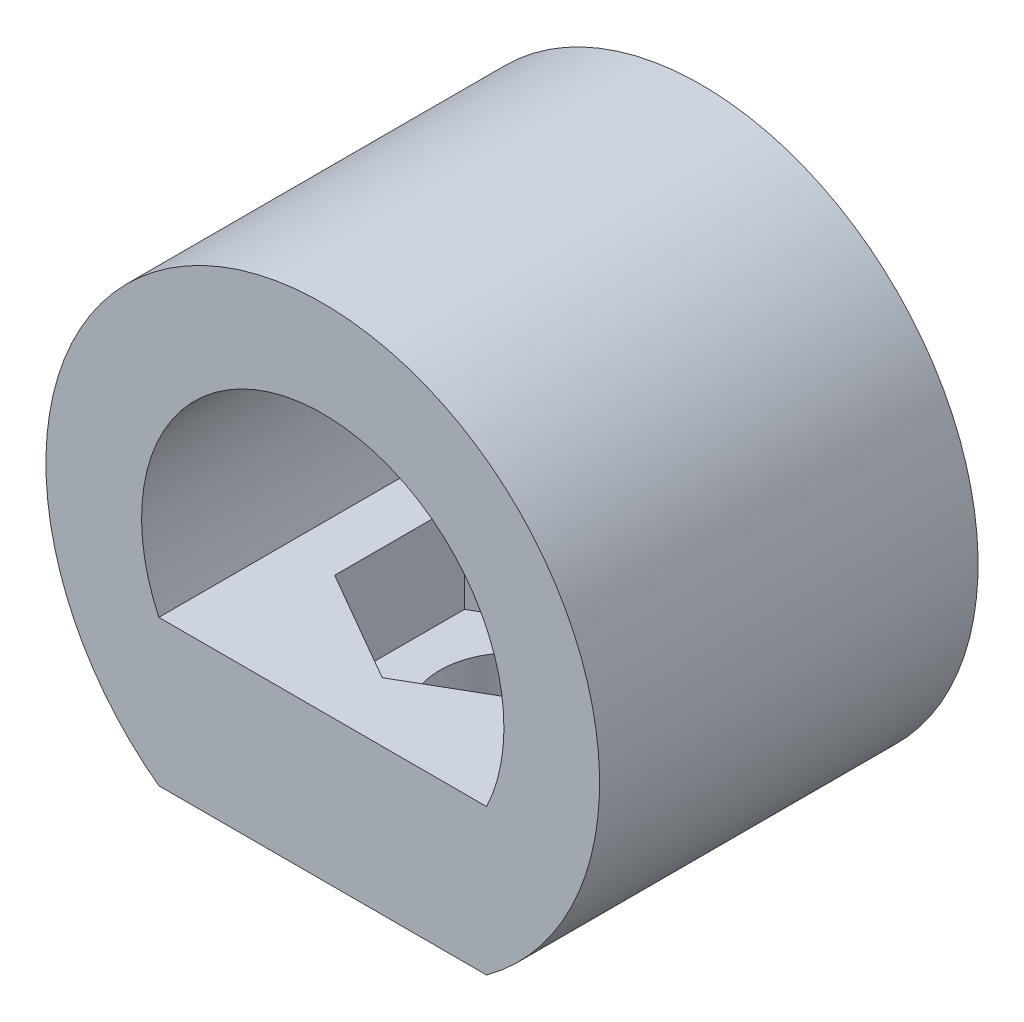
ISO-10303-21;
HEADER;
FILE_DESCRIPTION(('STEP AP214'),'2;1');
FILE_NAME('part.step','',(''),(''),'','','');
FILE_SCHEMA(('AUTOMOTIVE_DESIGN { 1 0 10303 214 1 1 1 1 }'));
ENDSEC;
DATA;
#1=APPLICATION_CONTEXT('core data for automotive mechanical design processes');
#2=APPLICATION_PROTOCOL_DEFINITION('international standard','automotive_design',2000,#1);
#3=PRODUCT_CONTEXT('',#1,'mechanical');
#4=PRODUCT('Part','Part','',(#3));
#5=PRODUCT_RELATED_PRODUCT_CATEGORY('part','',(#4));
#6=PRODUCT_DEFINITION_FORMATION('','',#4);
#7=PRODUCT_DEFINITION_CONTEXT('part definition',#1,'design');
#8=PRODUCT_DEFINITION('design','',#6,#7);
#9=PRODUCT_DEFINITION_SHAPE('','',#8);
#10=(LENGTH_UNIT() NAMED_UNIT(*) SI_UNIT(.MILLI.,.METRE.));
#11=(NAMED_UNIT(*) PLANE_ANGLE_UNIT() SI_UNIT($,.RADIAN.));
#12=(NAMED_UNIT(*) SI_UNIT($,.STERADIAN.) SOLID_ANGLE_UNIT());
#13=UNCERTAINTY_MEASURE_WITH_UNIT(LENGTH_MEASURE(1.E-05),#10,'distance_accuracy_value','');
#14=(GEOMETRIC_REPRESENTATION_CONTEXT(3) GLOBAL_UNCERTAINTY_ASSIGNED_CONTEXT((#13)) GLOBAL_UNIT_ASSIGNED_CONTEXT((#10,
#11,#12)) REPRESENTATION_CONTEXT('',''));
#15=CARTESIAN_POINT('',(0.,0.,0.));
#16=DIRECTION('',(0.,0.,1.));
#17=DIRECTION('',(1.,0.,0.));
#18=AXIS2_PLACEMENT_3D('',#15,#16,#17);
#19=CARTESIAN_POINT('',(0.,5.5,11.0273901415219));
#20=DIRECTION('',(0.,0.,-1.));
#21=DIRECTION('',(-1.,0.,0.));
#22=AXIS2_PLACEMENT_3D('',#19,#20,#21);
#23=PLANE('',#22);
#24=CARTESIAN_POINT('',(0.,10.,11.0273901415219));
#25=DIRECTION('',(0.,0.,-1.));
#26=DIRECTION('',(-1.,0.,0.));
#27=AXIS2_PLACEMENT_3D('',#24,#25,#26);
#28=CIRCLE('',#27,16.1307935328675);
#29=CARTESIAN_POINT('',(-9.55000000000001,-3.,11.0273901415219));
#30=VERTEX_POINT('',#29);
#31=CARTESIAN_POINT('',(9.55000000000001,-3.,11.0273901415219));
#32=VERTEX_POINT('',#31);
#33=EDGE_CURVE('E211',#30,#32,#28,.T.);
#34=ORIENTED_EDGE('',*,*,#33,.F.);
#35=DIRECTION('',(-1.,0.,0.));
#36=VECTOR('',#35,1.);
#37=CARTESIAN_POINT('',(-9.55000000000001,-3.,11.0273901415219));
#38=LINE('',#37,#36);
#39=EDGE_CURVE('E136',#32,#30,#38,.T.);
#40=ORIENTED_EDGE('',*,*,#39,.F.);
#41=EDGE_LOOP('',(#34,#40));
#42=FACE_BOUND('',#41,.T.);
#43=DIRECTION('',(1.,0.,0.));
#44=VECTOR('',#43,1.);
#45=CARTESIAN_POINT('',(0.,5.5,11.0273901415219));
#46=LINE('',#45,#44);
#47=CARTESIAN_POINT('',(-9.55000000000001,5.5,11.0273901415219));
#48=VERTEX_POINT('',#47);
#49=CARTESIAN_POINT('',(9.55000000000001,5.5,11.0273901415219));
#50=VERTEX_POINT('',#49);
#51=EDGE_CURVE('E123',#48,#50,#46,.T.);
#52=ORIENTED_EDGE('',*,*,#51,.F.);
#53=CARTESIAN_POINT('',(0.,10.,11.0273901415219));
#54=DIRECTION('',(0.,0.,-1.));
#55=DIRECTION('',(-1.,0.,0.));
#56=AXIS2_PLACEMENT_3D('',#53,#54,#55);
#57=CIRCLE('',#56,10.5571066111885);
#58=EDGE_CURVE('E253',#48,#50,#57,.T.);
#59=ORIENTED_EDGE('',*,*,#58,.T.);
#60=EDGE_LOOP('',(#52,#59));
#61=FACE_BOUND('',#60,.T.);
#62=ADVANCED_FACE('F37',(#42,#61),#23,.F.);
#63=CARTESIAN_POINT('',(3.275,5.5,5.67246639478808));
#64=DIRECTION('',(-0.5,0.,-0.866025403784439));
#65=DIRECTION('',(-0.866025403784439,0.,0.5));
#66=AXIS2_PLACEMENT_3D('',#63,#64,#65);
#67=PLANE('',#66);
#68=DIRECTION('',(0.866025403784439,0.,-0.5));
#69=VECTOR('',#68,1.);
#70=CARTESIAN_POINT('',(3.275,0.,5.67246639478808));
#71=LINE('',#70,#69);
#72=CARTESIAN_POINT('',(0.,0.,7.56328852638411));
#73=VERTEX_POINT('',#72);
#74=CARTESIAN_POINT('',(6.55,0.,3.78164426319205));
#75=VERTEX_POINT('',#74);
#76=EDGE_CURVE('E132',#73,#75,#71,.T.);
#77=ORIENTED_EDGE('',*,*,#76,.F.);
#78=DIRECTION('',(0.,-1.,0.));
#79=VECTOR('',#78,1.);
#80=CARTESIAN_POINT('',(0.,5.5,7.56328852638411));
#81=LINE('',#80,#79);
#82=CARTESIAN_POINT('',(0.,5.5,7.56328852638411));
#83=VERTEX_POINT('',#82);
#84=EDGE_CURVE('E11',#83,#73,#81,.T.);
#85=ORIENTED_EDGE('',*,*,#84,.F.);
#86=DIRECTION('',(0.866025403784439,0.,-0.5));
#87=VECTOR('',#86,1.);
#88=CARTESIAN_POINT('',(3.275,5.5,5.67246639478808));
#89=LINE('',#88,#87);
#90=CARTESIAN_POINT('',(6.55,5.5,3.78164426319205));
#91=VERTEX_POINT('',#90);
#92=EDGE_CURVE('E148',#83,#91,#89,.T.);
#93=ORIENTED_EDGE('',*,*,#92,.T.);
#94=DIRECTION('',(0.,-1.,0.));
#95=VECTOR('',#94,1.);
#96=CARTESIAN_POINT('',(6.55,5.5,3.78164426319205));
#97=LINE('',#96,#95);
#98=EDGE_CURVE('E54',#91,#75,#97,.T.);
#99=ORIENTED_EDGE('',*,*,#98,.T.);
#100=EDGE_LOOP('',(#77,#85,#93,#99));
#101=FACE_BOUND('',#100,.T.);
#102=ADVANCED_FACE('F39',(#101),#67,.T.);
#103=CARTESIAN_POINT('',(-3.27500000000001,5.5,5.67246639478808));
#104=DIRECTION('',(0.500000000000001,0.,-0.866025403784438));
#105=DIRECTION('',(-0.866025403784438,0.,-0.500000000000001));
#106=AXIS2_PLACEMENT_3D('',#103,#104,#105);
#107=PLANE('',#106);
#108=DIRECTION('',(0.866025403784438,0.,0.500000000000001));
#109=VECTOR('',#108,1.);
#110=CARTESIAN_POINT('',(-3.27500000000001,0.,5.67246639478808));
#111=LINE('',#110,#109);
#112=CARTESIAN_POINT('',(-6.55000000000001,0.,3.78164426319205));
#113=VERTEX_POINT('',#112);
#114=EDGE_CURVE('E135',#113,#73,#111,.T.);
#115=ORIENTED_EDGE('',*,*,#114,.F.);
#116=DIRECTION('',(0.,-1.,0.));
#117=VECTOR('',#116,1.);
#118=CARTESIAN_POINT('',(-6.55000000000001,5.5,3.78164426319205));
#119=LINE('',#118,#117);
#120=CARTESIAN_POINT('',(-6.55000000000001,5.5,3.78164426319205));
#121=VERTEX_POINT('',#120);
#122=EDGE_CURVE('E46',#121,#113,#119,.T.);
#123=ORIENTED_EDGE('',*,*,#122,.F.);
#124=DIRECTION('',(0.866025403784438,0.,0.500000000000001));
#125=VECTOR('',#124,1.);
#126=CARTESIAN_POINT('',(-3.27500000000001,5.5,5.67246639478808));
#127=LINE('',#126,#125);
#128=EDGE_CURVE('E232',#121,#83,#127,.T.);
#129=ORIENTED_EDGE('',*,*,#128,.T.);
#130=ORIENTED_EDGE('',*,*,#84,.T.);
#131=EDGE_LOOP('',(#115,#123,#129,#130));
#132=FACE_BOUND('',#131,.T.);
#133=ADVANCED_FACE('F157',(#132),#107,.T.);
#134=CARTESIAN_POINT('',(-6.55000000000001,5.5,0.));
#135=DIRECTION('',(1.,0.,0.));
#136=DIRECTION('',(0.,0.,-1.));
#137=AXIS2_PLACEMENT_3D('',#134,#135,#136);
#138=PLANE('',#137);
#139=DIRECTION('',(0.,0.,1.));
#140=VECTOR('',#139,1.);
#141=CARTESIAN_POINT('',(-6.55000000000001,0.,0.));
#142=LINE('',#141,#140);
#143=CARTESIAN_POINT('',(-6.55000000000001,0.,-3.78164426319206));
#144=VERTEX_POINT('',#143);
#145=EDGE_CURVE('E139',#144,#113,#142,.T.);
#146=ORIENTED_EDGE('',*,*,#145,.F.);
#147=DIRECTION('',(0.,-1.,0.));
#148=VECTOR('',#147,1.);
#149=CARTESIAN_POINT('',(-6.55000000000001,5.5,-3.78164426319206));
#150=LINE('',#149,#148);
#151=CARTESIAN_POINT('',(-6.55000000000001,5.5,-3.78164426319206));
#152=VERTEX_POINT('',#151);
#153=EDGE_CURVE('E101',#152,#144,#150,.T.);
#154=ORIENTED_EDGE('',*,*,#153,.F.);
#155=DIRECTION('',(0.,0.,1.));
#156=VECTOR('',#155,1.);
#157=CARTESIAN_POINT('',(-6.55000000000001,5.5,0.));
#158=LINE('',#157,#156);
#159=EDGE_CURVE('E112',#152,#121,#158,.T.);
#160=ORIENTED_EDGE('',*,*,#159,.T.);
#161=ORIENTED_EDGE('',*,*,#122,.T.);
#162=EDGE_LOOP('',(#146,#154,#160,#161));
#163=FACE_BOUND('',#162,.T.);
#164=ADVANCED_FACE('F154',(#163),#138,.T.);
#165=CARTESIAN_POINT('',(-3.27500000000001,5.5,-5.67246639478808));
#166=DIRECTION('',(0.5,0.,0.866025403784438));
#167=DIRECTION('',(0.866025403784438,0.,-0.5));
#168=AXIS2_PLACEMENT_3D('',#165,#166,#167);
#169=PLANE('',#168);
#170=DIRECTION('',(-0.866025403784438,0.,0.5));
#171=VECTOR('',#170,1.);
#172=CARTESIAN_POINT('',(-3.27500000000001,0.,-5.67246639478808));
#173=LINE('',#172,#171);
#174=CARTESIAN_POINT('',(0.,0.,-7.56328852638411));
#175=VERTEX_POINT('',#174);
#176=EDGE_CURVE('E97',#175,#144,#173,.T.);
#177=ORIENTED_EDGE('',*,*,#176,.F.);
#178=DIRECTION('',(0.,-1.,0.));
#179=VECTOR('',#178,1.);
#180=CARTESIAN_POINT('',(0.,5.5,-7.56328852638411));
#181=LINE('',#180,#179);
#182=CARTESIAN_POINT('',(0.,5.5,-7.56328852638411));
#183=VERTEX_POINT('',#182);
#184=EDGE_CURVE('E92',#183,#175,#181,.T.);
#185=ORIENTED_EDGE('',*,*,#184,.F.);
#186=DIRECTION('',(-0.866025403784438,0.,0.5));
#187=VECTOR('',#186,1.);
#188=CARTESIAN_POINT('',(-3.27500000000001,5.5,-5.67246639478808));
#189=LINE('',#188,#187);
#190=EDGE_CURVE('E95',#183,#152,#189,.T.);
#191=ORIENTED_EDGE('',*,*,#190,.T.);
#192=ORIENTED_EDGE('',*,*,#153,.T.);
#193=EDGE_LOOP('',(#177,#185,#191,#192));
#194=FACE_BOUND('',#193,.T.);
#195=ADVANCED_FACE('F94',(#194),#169,.T.);
#196=CARTESIAN_POINT('',(3.275,5.5,-5.67246639478808));
#197=DIRECTION('',(-0.5,0.,0.866025403784439));
#198=DIRECTION('',(0.866025403784439,0.,0.5));
#199=AXIS2_PLACEMENT_3D('',#196,#197,#198);
#200=PLANE('',#199);
#201=DIRECTION('',(-0.866025403784439,0.,-0.5));
#202=VECTOR('',#201,1.);
#203=CARTESIAN_POINT('',(3.275,0.,-5.67246639478808));
#204=LINE('',#203,#202);
#205=CARTESIAN_POINT('',(6.55,0.,-3.78164426319205));
#206=VERTEX_POINT('',#205);
#207=EDGE_CURVE('E143',#206,#175,#204,.T.);
#208=ORIENTED_EDGE('',*,*,#207,.F.);
#209=DIRECTION('',(0.,-1.,0.));
#210=VECTOR('',#209,1.);
#211=CARTESIAN_POINT('',(6.55,5.5,-3.78164426319205));
#212=LINE('',#211,#210);
#213=CARTESIAN_POINT('',(6.55,5.5,-3.78164426319205));
#214=VERTEX_POINT('',#213);
#215=EDGE_CURVE('E72',#214,#206,#212,.T.);
#216=ORIENTED_EDGE('',*,*,#215,.F.);
#217=DIRECTION('',(-0.866025403784439,0.,-0.5));
#218=VECTOR('',#217,1.);
#219=CARTESIAN_POINT('',(3.275,5.5,-5.67246639478808));
#220=LINE('',#219,#218);
#221=EDGE_CURVE('E109',#214,#183,#220,.T.);
#222=ORIENTED_EDGE('',*,*,#221,.T.);
#223=ORIENTED_EDGE('',*,*,#184,.T.);
#224=EDGE_LOOP('',(#208,#216,#222,#223));
#225=FACE_BOUND('',#224,.T.);
#226=ADVANCED_FACE('F114',(#225),#200,.T.);
#227=CARTESIAN_POINT('',(6.55,5.5,0.));
#228=DIRECTION('',(-1.,0.,0.));
#229=DIRECTION('',(0.,0.,1.));
#230=AXIS2_PLACEMENT_3D('',#227,#228,#229);
#231=PLANE('',#230);
#232=DIRECTION('',(0.,0.,-1.));
#233=VECTOR('',#232,1.);
#234=CARTESIAN_POINT('',(6.55,0.,0.));
#235=LINE('',#234,#233);
#236=EDGE_CURVE('E145',#75,#206,#235,.T.);
#237=ORIENTED_EDGE('',*,*,#236,.F.);
#238=ORIENTED_EDGE('',*,*,#98,.F.);
#239=DIRECTION('',(0.,0.,-1.));
#240=VECTOR('',#239,1.);
#241=CARTESIAN_POINT('',(6.55,5.5,0.));
#242=LINE('',#241,#240);
#243=EDGE_CURVE('E115',#91,#214,#242,.T.);
#244=ORIENTED_EDGE('',*,*,#243,.T.);
#245=ORIENTED_EDGE('',*,*,#215,.T.);
#246=EDGE_LOOP('',(#237,#238,#244,#245));
#247=FACE_BOUND('',#246,.T.);
#248=ADVANCED_FACE('F160',(#247),#231,.T.);
#249=CARTESIAN_POINT('',(0.,5.5,-11.0273901415219));
#250=DIRECTION('',(0.,0.,-1.));
#251=DIRECTION('',(-1.,0.,0.));
#252=AXIS2_PLACEMENT_3D('',#249,#250,#251);
#253=PLANE('',#252);
#254=DIRECTION('',(1.,0.,0.));
#255=VECTOR('',#254,1.);
#256=CARTESIAN_POINT('',(-9.55000000000001,-3.,-11.0273901415219));
#257=LINE('',#256,#255);
#258=CARTESIAN_POINT('',(-9.55000000000001,-3.,-11.0273901415219));
#259=VERTEX_POINT('',#258);
#260=CARTESIAN_POINT('',(9.55000000000001,-3.,-11.0273901415219));
#261=VERTEX_POINT('',#260);
#262=EDGE_CURVE('E221',#259,#261,#257,.T.);
#263=ORIENTED_EDGE('',*,*,#262,.F.);
#264=CARTESIAN_POINT('',(0.,10.,-11.0273901415219));
#265=DIRECTION('',(0.,0.,-1.));
#266=DIRECTION('',(-1.,0.,0.));
#267=AXIS2_PLACEMENT_3D('',#264,#265,#266);
#268=CIRCLE('',#267,16.1307935328675);
#269=EDGE_CURVE('E215',#261,#259,#268,.F.);
#270=ORIENTED_EDGE('',*,*,#269,.F.);
#271=EDGE_LOOP('',(#263,#270));
#272=FACE_BOUND('',#271,.T.);
#273=DIRECTION('',(1.,0.,0.));
#274=VECTOR('',#273,1.);
#275=CARTESIAN_POINT('',(0.,5.5,-11.0273901415219));
#276=LINE('',#275,#274);
#277=CARTESIAN_POINT('',(-9.55000000000001,5.5,-11.0273901415219));
#278=VERTEX_POINT('',#277);
#279=CARTESIAN_POINT('',(9.55000000000001,5.5,-11.0273901415219));
#280=VERTEX_POINT('',#279);
#281=EDGE_CURVE('E129',#278,#280,#276,.T.);
#282=ORIENTED_EDGE('',*,*,#281,.T.);
#283=CARTESIAN_POINT('',(0.,10.,-11.0273901415219));
#284=DIRECTION('',(0.,0.,-1.));
#285=DIRECTION('',(-1.,0.,0.));
#286=AXIS2_PLACEMENT_3D('',#283,#284,#285);
#287=CIRCLE('',#286,10.5571066111885);
#288=EDGE_CURVE('E247',#280,#278,#287,.F.);
#289=ORIENTED_EDGE('',*,*,#288,.T.);
#290=EDGE_LOOP('',(#282,#289));
#291=FACE_BOUND('',#290,.T.);
#292=ADVANCED_FACE('F162',(#272,#291),#253,.T.);
#293=CARTESIAN_POINT('',(0.,5.5,0.));
#294=DIRECTION('',(0.,1.,0.));
#295=DIRECTION('',(0.,0.,1.));
#296=AXIS2_PLACEMENT_3D('',#293,#294,#295);
#297=PLANE('',#296);
#298=ORIENTED_EDGE('',*,*,#92,.F.);
#299=ORIENTED_EDGE('',*,*,#128,.F.);
#300=ORIENTED_EDGE('',*,*,#159,.F.);
#301=ORIENTED_EDGE('',*,*,#190,.F.);
#302=ORIENTED_EDGE('',*,*,#221,.F.);
#303=ORIENTED_EDGE('',*,*,#243,.F.);
#304=EDGE_LOOP('',(#298,#299,#300,#301,#302,#303));
#305=FACE_BOUND('',#304,.T.);
#306=DIRECTION('',(0.,0.,1.));
#307=VECTOR('',#306,1.);
#308=CARTESIAN_POINT('',(-9.55000000000001,5.5,0.));
#309=LINE('',#308,#307);
#310=EDGE_CURVE('E117',#278,#48,#309,.T.);
#311=ORIENTED_EDGE('',*,*,#310,.T.);
#312=ORIENTED_EDGE('',*,*,#51,.T.);
#313=DIRECTION('',(0.,0.,-1.));
#314=VECTOR('',#313,1.);
#315=CARTESIAN_POINT('',(9.55,5.5,0.));
#316=LINE('',#315,#314);
#317=EDGE_CURVE('E126',#50,#280,#316,.T.);
#318=ORIENTED_EDGE('',*,*,#317,.T.);
#319=ORIENTED_EDGE('',*,*,#281,.F.);
#320=EDGE_LOOP('',(#311,#312,#318,#319));
#321=FACE_BOUND('',#320,.T.);
#322=ADVANCED_FACE('F106',(#305,#321),#297,.T.);
#323=CARTESIAN_POINT('',(0.,0.,0.));
#324=DIRECTION('',(0.,-1.,0.));
#325=DIRECTION('',(0.,0.,-1.));
#326=AXIS2_PLACEMENT_3D('',#323,#324,#325);
#327=PLANE('',#326);
#328=CARTESIAN_POINT('',(0.,0.,0.));
#329=DIRECTION('',(0.,-1.,0.));
#330=DIRECTION('',(0.,0.,-1.));
#331=AXIS2_PLACEMENT_3D('',#328,#329,#330);
#332=CIRCLE('',#331,4.2);
#333=CARTESIAN_POINT('',(0.,0.,-4.2));
#334=VERTEX_POINT('',#333);
#335=EDGE_CURVE('E250',#334,#334,#332,.T.);
#336=ORIENTED_EDGE('',*,*,#335,.T.);
#337=EDGE_LOOP('',(#336));
#338=FACE_BOUND('',#337,.T.);
#339=ORIENTED_EDGE('',*,*,#114,.T.);
#340=ORIENTED_EDGE('',*,*,#76,.T.);
#341=ORIENTED_EDGE('',*,*,#236,.T.);
#342=ORIENTED_EDGE('',*,*,#207,.T.);
#343=ORIENTED_EDGE('',*,*,#176,.T.);
#344=ORIENTED_EDGE('',*,*,#145,.T.);
#345=EDGE_LOOP('',(#339,#340,#341,#342,#343,#344));
#346=FACE_BOUND('',#345,.T.);
#347=ADVANCED_FACE('F159',(#338,#346),#327,.F.);
#348=CARTESIAN_POINT('',(0.,-3.,0.));
#349=DIRECTION('',(0.,-1.,0.));
#350=DIRECTION('',(0.,0.,-1.));
#351=AXIS2_PLACEMENT_3D('',#348,#349,#350);
#352=PLANE('',#351);
#353=DIRECTION('',(0.,0.,-1.));
#354=VECTOR('',#353,1.);
#355=CARTESIAN_POINT('',(-9.55000000000001,-3.,11.0273901415219));
#356=LINE('',#355,#354);
#357=EDGE_CURVE('E207',#30,#259,#356,.T.);
#358=ORIENTED_EDGE('',*,*,#357,.T.);
#359=ORIENTED_EDGE('',*,*,#262,.T.);
#360=DIRECTION('',(0.,0.,1.));
#361=VECTOR('',#360,1.);
#362=CARTESIAN_POINT('',(9.55000000000001,-3.,11.0273901415219));
#363=LINE('',#362,#361);
#364=EDGE_CURVE('E226',#261,#32,#363,.T.);
#365=ORIENTED_EDGE('',*,*,#364,.T.);
#366=ORIENTED_EDGE('',*,*,#39,.T.);
#367=EDGE_LOOP('',(#358,#359,#365,#366));
#368=FACE_BOUND('',#367,.T.);
#369=CARTESIAN_POINT('',(0.,-3.,0.));
#370=DIRECTION('',(0.,-1.,0.));
#371=DIRECTION('',(0.,0.,-1.));
#372=AXIS2_PLACEMENT_3D('',#369,#370,#371);
#373=CIRCLE('',#372,4.2);
#374=CARTESIAN_POINT('',(0.,-3.,-4.2));
#375=VERTEX_POINT('',#374);
#376=EDGE_CURVE('E222',#375,#375,#373,.T.);
#377=ORIENTED_EDGE('',*,*,#376,.F.);
#378=EDGE_LOOP('',(#377));
#379=FACE_BOUND('',#378,.T.);
#380=ADVANCED_FACE('F184',(#368,#379),#352,.T.);
#381=CARTESIAN_POINT('',(0.,-3.,0.));
#382=DIRECTION('',(0.,1.,0.));
#383=DIRECTION('',(0.,0.,1.));
#384=AXIS2_PLACEMENT_3D('',#381,#382,#383);
#385=CYLINDRICAL_SURFACE('',#384,4.2);
#386=ORIENTED_EDGE('',*,*,#376,.T.);
#387=EDGE_LOOP('',(#386));
#388=FACE_BOUND('',#387,.T.);
#389=ORIENTED_EDGE('',*,*,#335,.F.);
#390=EDGE_LOOP('',(#389));
#391=FACE_BOUND('',#390,.T.);
#392=ADVANCED_FACE('F188',(#388,#391),#385,.F.);
#393=CARTESIAN_POINT('',(0.,10.,54.4947702311311));
#394=DIRECTION('',(0.,0.,-1.));
#395=DIRECTION('',(-1.,0.,0.));
#396=AXIS2_PLACEMENT_3D('',#393,#394,#395);
#397=CYLINDRICAL_SURFACE('',#396,16.1307935328675);
#398=ORIENTED_EDGE('',*,*,#357,.F.);
#399=ORIENTED_EDGE('',*,*,#33,.T.);
#400=ORIENTED_EDGE('',*,*,#364,.F.);
#401=ORIENTED_EDGE('',*,*,#269,.T.);
#402=EDGE_LOOP('',(#398,#399,#400,#401));
#403=FACE_BOUND('',#402,.T.);
#404=ADVANCED_FACE('F192',(#403),#397,.T.);
#405=CARTESIAN_POINT('',(0.,10.,54.4947702311311));
#406=DIRECTION('',(0.,0.,-1.));
#407=DIRECTION('',(-1.,0.,0.));
#408=AXIS2_PLACEMENT_3D('',#405,#406,#407);
#409=CYLINDRICAL_SURFACE('',#408,10.5571066111885);
#410=ORIENTED_EDGE('',*,*,#58,.F.);
#411=ORIENTED_EDGE('',*,*,#310,.F.);
#412=ORIENTED_EDGE('',*,*,#288,.F.);
#413=ORIENTED_EDGE('',*,*,#317,.F.);
#414=EDGE_LOOP('',(#410,#411,#412,#413));
#415=FACE_BOUND('',#414,.T.);
#416=ADVANCED_FACE('F194',(#415),#409,.F.);
#417=CLOSED_SHELL('',(#62,#102,#133,#164,#195,#226,#248,#292,#322,#347,#380,#392,#404,#416));
#418=MANIFOLD_SOLID_BREP('B2',#417);
#419=ADVANCED_BREP_SHAPE_REPRESENTATION('',(#18,#418),#14);
#420=SHAPE_DEFINITION_REPRESENTATION(#9,#419);
ENDSEC;
END-ISO-10303-21;
